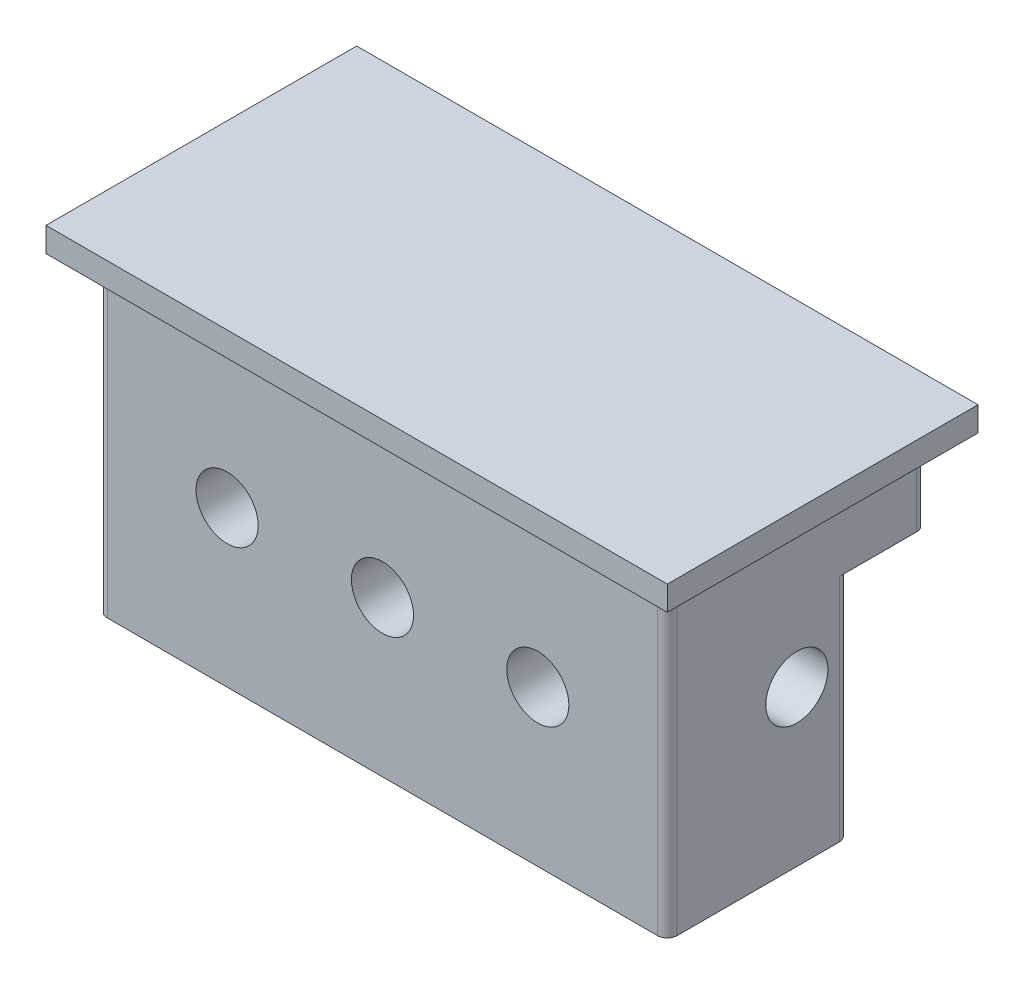
ISO-10303-21;
HEADER;
FILE_DESCRIPTION(('STEP AP214'),'2;1');
FILE_NAME('part.step','',(''),(''),'','','');
FILE_SCHEMA(('AUTOMOTIVE_DESIGN { 1 0 10303 214 1 1 1 1 }'));
ENDSEC;
DATA;
#1=APPLICATION_CONTEXT('core data for automotive mechanical design processes');
#2=APPLICATION_PROTOCOL_DEFINITION('international standard','automotive_design',2000,#1);
#3=PRODUCT_CONTEXT('',#1,'mechanical');
#4=PRODUCT('Part','Part','',(#3));
#5=PRODUCT_RELATED_PRODUCT_CATEGORY('part','',(#4));
#6=PRODUCT_DEFINITION_FORMATION('','',#4);
#7=PRODUCT_DEFINITION_CONTEXT('part definition',#1,'design');
#8=PRODUCT_DEFINITION('design','',#6,#7);
#9=PRODUCT_DEFINITION_SHAPE('','',#8);
#10=(LENGTH_UNIT() NAMED_UNIT(*) SI_UNIT(.MILLI.,.METRE.));
#11=(NAMED_UNIT(*) PLANE_ANGLE_UNIT() SI_UNIT($,.RADIAN.));
#12=(NAMED_UNIT(*) SI_UNIT($,.STERADIAN.) SOLID_ANGLE_UNIT());
#13=UNCERTAINTY_MEASURE_WITH_UNIT(LENGTH_MEASURE(1.E-05),#10,'distance_accuracy_value','');
#14=(GEOMETRIC_REPRESENTATION_CONTEXT(3) GLOBAL_UNCERTAINTY_ASSIGNED_CONTEXT((#13)) GLOBAL_UNIT_ASSIGNED_CONTEXT((#10,
#11,#12)) REPRESENTATION_CONTEXT('',''));
#15=CARTESIAN_POINT('',(0.,0.,0.));
#16=DIRECTION('',(0.,0.,1.));
#17=DIRECTION('',(1.,0.,0.));
#18=AXIS2_PLACEMENT_3D('',#15,#16,#17);
#19=CARTESIAN_POINT('',(0.,-12.7,-12.7));
#20=DIRECTION('',(1.,0.,0.));
#21=DIRECTION('',(0.,0.,-1.));
#22=AXIS2_PLACEMENT_3D('',#19,#20,#21);
#23=CYLINDRICAL_SURFACE('',#22,2.54000000000001);
#24=CARTESIAN_POINT('',(48.6918,-12.7,-12.7));
#25=DIRECTION('',(1.,0.,0.));
#26=DIRECTION('',(0.,0.,-1.));
#27=AXIS2_PLACEMENT_3D('',#24,#25,#26);
#28=CIRCLE('',#27,2.54000000000001);
#29=CARTESIAN_POINT('',(48.6918,-12.7,-15.24));
#30=VERTEX_POINT('',#29);
#31=EDGE_CURVE('E417',#30,#30,#28,.T.);
#32=ORIENTED_EDGE('',*,*,#31,.T.);
#33=EDGE_LOOP('',(#32));
#34=FACE_BOUND('',#33,.T.);
#35=CARTESIAN_POINT('',(38.1,-12.7,-12.7));
#36=DIRECTION('',(0.707106781186547,0.,0.707106781186548));
#37=DIRECTION('',(0.707106781186547,0.,-0.707106781186548));
#38=AXIS2_PLACEMENT_3D('',#35,#36,#37);
#39=ELLIPSE('',#38,3.59210244842768,2.54000000000001);
#40=CARTESIAN_POINT('',(38.1,-10.16,-12.7));
#41=VERTEX_POINT('',#40);
#42=CARTESIAN_POINT('',(38.1,-15.24,-12.7));
#43=VERTEX_POINT('',#42);
#44=EDGE_CURVE('E230',#41,#43,#39,.F.);
#45=ORIENTED_EDGE('',*,*,#44,.T.);
#46=CARTESIAN_POINT('',(38.1,-12.7,-12.7));
#47=DIRECTION('',(0.707106781186547,0.,-0.707106781186548));
#48=DIRECTION('',(0.707106781186547,0.,0.707106781186548));
#49=AXIS2_PLACEMENT_3D('',#46,#47,#48);
#50=ELLIPSE('',#49,3.59210244842768,2.54000000000001);
#51=EDGE_CURVE('E238',#43,#41,#50,.F.);
#52=ORIENTED_EDGE('',*,*,#51,.T.);
#53=EDGE_LOOP('',(#45,#52));
#54=FACE_BOUND('',#53,.T.);
#55=ADVANCED_FACE('F37',(#34,#54),#23,.F.);
#56=CARTESIAN_POINT('',(0.,0.,0.));
#57=DIRECTION('',(0.,1.,0.));
#58=DIRECTION('',(0.,0.,1.));
#59=AXIS2_PLACEMENT_3D('',#56,#57,#58);
#60=PLANE('',#59);
#61=DIRECTION('',(1.,0.,0.));
#62=VECTOR('',#61,1.);
#63=CARTESIAN_POINT('',(0.,0.,0.));
#64=LINE('',#63,#62);
#65=CARTESIAN_POINT('',(0.,0.,0.));
#66=VERTEX_POINT('',#65);
#67=CARTESIAN_POINT('',(50.8,0.,0.));
#68=VERTEX_POINT('',#67);
#69=EDGE_CURVE('E297',#66,#68,#64,.T.);
#70=ORIENTED_EDGE('',*,*,#69,.F.);
#71=DIRECTION('',(0.,0.,-1.));
#72=VECTOR('',#71,1.);
#73=CARTESIAN_POINT('',(0.,0.,0.));
#74=LINE('',#73,#72);
#75=CARTESIAN_POINT('',(0.,0.,-25.4));
#76=VERTEX_POINT('',#75);
#77=EDGE_CURVE('E324',#66,#76,#74,.T.);
#78=ORIENTED_EDGE('',*,*,#77,.T.);
#79=DIRECTION('',(1.,0.,0.));
#80=VECTOR('',#79,1.);
#81=CARTESIAN_POINT('',(0.,0.,-25.4));
#82=LINE('',#81,#80);
#83=CARTESIAN_POINT('',(50.8,0.,-25.4));
#84=VERTEX_POINT('',#83);
#85=EDGE_CURVE('E335',#76,#84,#82,.T.);
#86=ORIENTED_EDGE('',*,*,#85,.T.);
#87=DIRECTION('',(0.,0.,-1.));
#88=VECTOR('',#87,1.);
#89=CARTESIAN_POINT('',(50.8,0.,0.));
#90=LINE('',#89,#88);
#91=EDGE_CURVE('E301',#68,#84,#90,.T.);
#92=ORIENTED_EDGE('',*,*,#91,.F.);
#93=EDGE_LOOP('',(#70,#78,#86,#92));
#94=FACE_BOUND('',#93,.T.);
#95=DIRECTION('',(0.,0.,-1.));
#96=VECTOR('',#95,1.);
#97=CARTESIAN_POINT('',(2.1082,0.,0.));
#98=LINE('',#97,#96);
#99=CARTESIAN_POINT('',(2.1082,0.,-2.90195));
#100=VERTEX_POINT('',#99);
#101=CARTESIAN_POINT('',(2.1082,0.,-22.49805));
#102=VERTEX_POINT('',#101);
#103=EDGE_CURVE('E308',#100,#102,#98,.T.);
#104=ORIENTED_EDGE('',*,*,#103,.F.);
#105=CARTESIAN_POINT('',(2.90195,0.,-2.90195));
#106=DIRECTION('',(0.,1.,0.));
#107=DIRECTION('',(0.,0.,1.));
#108=AXIS2_PLACEMENT_3D('',#105,#106,#107);
#109=CIRCLE('',#108,0.79375);
#110=CARTESIAN_POINT('',(2.90195,0.,-2.1082));
#111=VERTEX_POINT('',#110);
#112=EDGE_CURVE('E215',#100,#111,#109,.T.);
#113=ORIENTED_EDGE('',*,*,#112,.T.);
#114=DIRECTION('',(1.,0.,0.));
#115=VECTOR('',#114,1.);
#116=CARTESIAN_POINT('',(0.,0.,-2.1082));
#117=LINE('',#116,#115);
#118=CARTESIAN_POINT('',(47.89805,0.,-2.1082));
#119=VERTEX_POINT('',#118);
#120=EDGE_CURVE('E311',#111,#119,#117,.T.);
#121=ORIENTED_EDGE('',*,*,#120,.T.);
#122=CARTESIAN_POINT('',(47.89805,0.,-2.90195));
#123=DIRECTION('',(0.,1.,0.));
#124=DIRECTION('',(0.,0.,1.));
#125=AXIS2_PLACEMENT_3D('',#122,#123,#124);
#126=CIRCLE('',#125,0.79375);
#127=CARTESIAN_POINT('',(48.6918,0.,-2.90195));
#128=VERTEX_POINT('',#127);
#129=EDGE_CURVE('E213',#119,#128,#126,.T.);
#130=ORIENTED_EDGE('',*,*,#129,.T.);
#131=DIRECTION('',(0.,0.,-1.));
#132=VECTOR('',#131,1.);
#133=CARTESIAN_POINT('',(48.6918,0.,0.));
#134=LINE('',#133,#132);
#135=CARTESIAN_POINT('',(48.6918,0.,-22.49805));
#136=VERTEX_POINT('',#135);
#137=EDGE_CURVE('E315',#128,#136,#134,.T.);
#138=ORIENTED_EDGE('',*,*,#137,.T.);
#139=CARTESIAN_POINT('',(47.89805,0.,-22.49805));
#140=DIRECTION('',(0.,1.,0.));
#141=DIRECTION('',(0.,0.,1.));
#142=AXIS2_PLACEMENT_3D('',#139,#140,#141);
#143=CIRCLE('',#142,0.79375);
#144=CARTESIAN_POINT('',(47.89805,0.,-23.2918));
#145=VERTEX_POINT('',#144);
#146=EDGE_CURVE('E217',#136,#145,#143,.T.);
#147=ORIENTED_EDGE('',*,*,#146,.T.);
#148=DIRECTION('',(1.,0.,0.));
#149=VECTOR('',#148,1.);
#150=CARTESIAN_POINT('',(0.,0.,-23.2918));
#151=LINE('',#150,#149);
#152=CARTESIAN_POINT('',(2.90195,0.,-23.2918));
#153=VERTEX_POINT('',#152);
#154=EDGE_CURVE('E318',#153,#145,#151,.T.);
#155=ORIENTED_EDGE('',*,*,#154,.F.);
#156=CARTESIAN_POINT('',(2.90195,0.,-22.49805));
#157=DIRECTION('',(0.,1.,0.));
#158=DIRECTION('',(0.,0.,1.));
#159=AXIS2_PLACEMENT_3D('',#156,#157,#158);
#160=CIRCLE('',#159,0.79375);
#161=EDGE_CURVE('E187',#153,#102,#160,.T.);
#162=ORIENTED_EDGE('',*,*,#161,.T.);
#163=EDGE_LOOP('',(#104,#113,#121,#130,#138,#147,#155,#162));
#164=FACE_BOUND('',#163,.T.);
#165=ADVANCED_FACE('F355',(#94,#164),#60,.F.);
#166=CARTESIAN_POINT('',(0.,1.999996,0.));
#167=DIRECTION('',(0.,0.,-1.));
#168=DIRECTION('',(-1.,0.,0.));
#169=AXIS2_PLACEMENT_3D('',#166,#167,#168);
#170=PLANE('',#169);
#171=ORIENTED_EDGE('',*,*,#69,.T.);
#172=DIRECTION('',(0.,-1.,0.));
#173=VECTOR('',#172,1.);
#174=CARTESIAN_POINT('',(50.8,1.999996,0.));
#175=LINE('',#174,#173);
#176=CARTESIAN_POINT('',(50.8,1.999996,0.));
#177=VERTEX_POINT('',#176);
#178=EDGE_CURVE('E194',#177,#68,#175,.T.);
#179=ORIENTED_EDGE('',*,*,#178,.F.);
#180=DIRECTION('',(1.,0.,0.));
#181=VECTOR('',#180,1.);
#182=CARTESIAN_POINT('',(0.,1.999996,0.));
#183=LINE('',#182,#181);
#184=CARTESIAN_POINT('',(0.,1.999996,0.));
#185=VERTEX_POINT('',#184);
#186=EDGE_CURVE('E320',#185,#177,#183,.T.);
#187=ORIENTED_EDGE('',*,*,#186,.F.);
#188=DIRECTION('',(0.,-1.,0.));
#189=VECTOR('',#188,1.);
#190=CARTESIAN_POINT('',(0.,1.999996,0.));
#191=LINE('',#190,#189);
#192=EDGE_CURVE('E331',#185,#66,#191,.T.);
#193=ORIENTED_EDGE('',*,*,#192,.T.);
#194=EDGE_LOOP('',(#171,#179,#187,#193));
#195=FACE_BOUND('',#194,.T.);
#196=ADVANCED_FACE('F352',(#195),#170,.F.);
#197=CARTESIAN_POINT('',(50.8,1.999996,0.));
#198=DIRECTION('',(-1.,0.,0.));
#199=DIRECTION('',(0.,0.,1.));
#200=AXIS2_PLACEMENT_3D('',#197,#198,#199);
#201=PLANE('',#200);
#202=ORIENTED_EDGE('',*,*,#91,.T.);
#203=DIRECTION('',(0.,-1.,0.));
#204=VECTOR('',#203,1.);
#205=CARTESIAN_POINT('',(50.8,1.999996,-25.4));
#206=LINE('',#205,#204);
#207=CARTESIAN_POINT('',(50.8,1.999996,-25.4));
#208=VERTEX_POINT('',#207);
#209=EDGE_CURVE('E343',#208,#84,#206,.T.);
#210=ORIENTED_EDGE('',*,*,#209,.F.);
#211=DIRECTION('',(0.,0.,-1.));
#212=VECTOR('',#211,1.);
#213=CARTESIAN_POINT('',(50.8,1.999996,0.));
#214=LINE('',#213,#212);
#215=EDGE_CURVE('E323',#177,#208,#214,.T.);
#216=ORIENTED_EDGE('',*,*,#215,.F.);
#217=ORIENTED_EDGE('',*,*,#178,.T.);
#218=EDGE_LOOP('',(#202,#210,#216,#217));
#219=FACE_BOUND('',#218,.T.);
#220=ADVANCED_FACE('F347',(#219),#201,.F.);
#221=CARTESIAN_POINT('',(0.,1.999996,-25.4));
#222=DIRECTION('',(0.,0.,-1.));
#223=DIRECTION('',(-1.,0.,0.));
#224=AXIS2_PLACEMENT_3D('',#221,#222,#223);
#225=PLANE('',#224);
#226=ORIENTED_EDGE('',*,*,#85,.F.);
#227=DIRECTION('',(0.,-1.,0.));
#228=VECTOR('',#227,1.);
#229=CARTESIAN_POINT('',(0.,1.999996,-25.4));
#230=LINE('',#229,#228);
#231=CARTESIAN_POINT('',(0.,1.999996,-25.4));
#232=VERTEX_POINT('',#231);
#233=EDGE_CURVE('E341',#232,#76,#230,.T.);
#234=ORIENTED_EDGE('',*,*,#233,.F.);
#235=DIRECTION('',(1.,0.,0.));
#236=VECTOR('',#235,1.);
#237=CARTESIAN_POINT('',(0.,1.999996,-25.4));
#238=LINE('',#237,#236);
#239=EDGE_CURVE('E326',#232,#208,#238,.T.);
#240=ORIENTED_EDGE('',*,*,#239,.T.);
#241=ORIENTED_EDGE('',*,*,#209,.T.);
#242=EDGE_LOOP('',(#226,#234,#240,#241));
#243=FACE_BOUND('',#242,.T.);
#244=ADVANCED_FACE('F363',(#243),#225,.T.);
#245=CARTESIAN_POINT('',(0.,1.999996,0.));
#246=DIRECTION('',(-1.,0.,0.));
#247=DIRECTION('',(0.,0.,1.));
#248=AXIS2_PLACEMENT_3D('',#245,#246,#247);
#249=PLANE('',#248);
#250=ORIENTED_EDGE('',*,*,#77,.F.);
#251=ORIENTED_EDGE('',*,*,#192,.F.);
#252=DIRECTION('',(0.,0.,-1.));
#253=VECTOR('',#252,1.);
#254=CARTESIAN_POINT('',(0.,1.999996,0.));
#255=LINE('',#254,#253);
#256=EDGE_CURVE('E329',#185,#232,#255,.T.);
#257=ORIENTED_EDGE('',*,*,#256,.T.);
#258=ORIENTED_EDGE('',*,*,#233,.T.);
#259=EDGE_LOOP('',(#250,#251,#257,#258));
#260=FACE_BOUND('',#259,.T.);
#261=ADVANCED_FACE('F358',(#260),#249,.T.);
#262=CARTESIAN_POINT('',(0.,1.999996,0.));
#263=DIRECTION('',(0.,1.,0.));
#264=DIRECTION('',(0.,0.,1.));
#265=AXIS2_PLACEMENT_3D('',#262,#263,#264);
#266=PLANE('',#265);
#267=ORIENTED_EDGE('',*,*,#186,.T.);
#268=ORIENTED_EDGE('',*,*,#215,.T.);
#269=ORIENTED_EDGE('',*,*,#239,.F.);
#270=ORIENTED_EDGE('',*,*,#256,.F.);
#271=EDGE_LOOP('',(#267,#268,#269,#270));
#272=FACE_BOUND('',#271,.T.);
#273=ADVANCED_FACE('F365',(#272),#266,.T.);
#274=CARTESIAN_POINT('',(2.1082,-25.4,0.));
#275=DIRECTION('',(1.,0.,0.));
#276=DIRECTION('',(0.,0.,-1.));
#277=AXIS2_PLACEMENT_3D('',#274,#275,#276);
#278=PLANE('',#277);
#279=CARTESIAN_POINT('',(2.1082,-12.7,-12.7));
#280=DIRECTION('',(1.,0.,0.));
#281=DIRECTION('',(0.,0.,-1.));
#282=AXIS2_PLACEMENT_3D('',#279,#280,#281);
#283=CIRCLE('',#282,2.54000000000001);
#284=CARTESIAN_POINT('',(2.1082,-12.7,-15.24));
#285=VERTEX_POINT('',#284);
#286=EDGE_CURVE('E312',#285,#285,#283,.T.);
#287=ORIENTED_EDGE('',*,*,#286,.T.);
#288=EDGE_LOOP('',(#287));
#289=FACE_BOUND('',#288,.T.);
#290=DIRECTION('',(0.,0.,-1.));
#291=VECTOR('',#290,1.);
#292=CARTESIAN_POINT('',(2.1082,-6.604,-16.9418));
#293=LINE('',#292,#291);
#294=CARTESIAN_POINT('',(2.1082,-6.604,-16.1798));
#295=VERTEX_POINT('',#294);
#296=CARTESIAN_POINT('',(2.1082,-6.604,-22.49805));
#297=VERTEX_POINT('',#296);
#298=EDGE_CURVE('E52',#295,#297,#293,.T.);
#299=ORIENTED_EDGE('',*,*,#298,.F.);
#300=DIRECTION('',(0.,1.,0.));
#301=VECTOR('',#300,1.);
#302=CARTESIAN_POINT('',(2.1082,-25.4,-16.1798));
#303=LINE('',#302,#301);
#304=CARTESIAN_POINT('',(2.1082,-25.4,-16.1798));
#305=VERTEX_POINT('',#304);
#306=EDGE_CURVE('E270',#295,#305,#303,.F.);
#307=ORIENTED_EDGE('',*,*,#306,.T.);
#308=DIRECTION('',(0.,0.,-1.));
#309=VECTOR('',#308,1.);
#310=CARTESIAN_POINT('',(2.1082,-25.4,0.));
#311=LINE('',#310,#309);
#312=CARTESIAN_POINT('',(2.1082,-25.4,-2.90195));
#313=VERTEX_POINT('',#312);
#314=EDGE_CURVE('E304',#313,#305,#311,.T.);
#315=ORIENTED_EDGE('',*,*,#314,.F.);
#316=DIRECTION('',(0.,1.,0.));
#317=VECTOR('',#316,1.);
#318=CARTESIAN_POINT('',(2.1082,0.,-2.90195));
#319=LINE('',#318,#317);
#320=EDGE_CURVE('E189',#313,#100,#319,.T.);
#321=ORIENTED_EDGE('',*,*,#320,.T.);
#322=ORIENTED_EDGE('',*,*,#103,.T.);
#323=DIRECTION('',(0.,1.,0.));
#324=VECTOR('',#323,1.);
#325=CARTESIAN_POINT('',(2.1082,-25.4,-22.49805));
#326=LINE('',#325,#324);
#327=EDGE_CURVE('E192',#102,#297,#326,.F.);
#328=ORIENTED_EDGE('',*,*,#327,.T.);
#329=EDGE_LOOP('',(#299,#307,#315,#321,#322,#328));
#330=FACE_BOUND('',#329,.T.);
#331=ADVANCED_FACE('F367',(#289,#330),#278,.F.);
#332=CARTESIAN_POINT('',(0.,-25.4,-23.2918));
#333=DIRECTION('',(0.,0.,1.));
#334=DIRECTION('',(1.,0.,0.));
#335=AXIS2_PLACEMENT_3D('',#332,#333,#334);
#336=PLANE('',#335);
#337=DIRECTION('',(0.,1.,0.));
#338=VECTOR('',#337,1.);
#339=CARTESIAN_POINT('',(47.89805,-25.4,-23.2918));
#340=LINE('',#339,#338);
#341=CARTESIAN_POINT('',(47.89805,-6.604,-23.2918));
#342=VERTEX_POINT('',#341);
#343=EDGE_CURVE('E183',#145,#342,#340,.F.);
#344=ORIENTED_EDGE('',*,*,#343,.T.);
#345=DIRECTION('',(1.,0.,0.));
#346=VECTOR('',#345,1.);
#347=CARTESIAN_POINT('',(48.6918,-6.604,-23.2918));
#348=LINE('',#347,#346);
#349=CARTESIAN_POINT('',(2.90195,-6.604,-23.2918));
#350=VERTEX_POINT('',#349);
#351=EDGE_CURVE('E168',#350,#342,#348,.T.);
#352=ORIENTED_EDGE('',*,*,#351,.F.);
#353=DIRECTION('',(0.,1.,0.));
#354=VECTOR('',#353,1.);
#355=CARTESIAN_POINT('',(2.90195,-25.4,-23.2918));
#356=LINE('',#355,#354);
#357=EDGE_CURVE('E180',#350,#153,#356,.T.);
#358=ORIENTED_EDGE('',*,*,#357,.T.);
#359=ORIENTED_EDGE('',*,*,#154,.T.);
#360=EDGE_LOOP('',(#344,#352,#358,#359));
#361=FACE_BOUND('',#360,.T.);
#362=ADVANCED_FACE('F178',(#361),#336,.F.);
#363=CARTESIAN_POINT('',(48.6918,-25.4,0.));
#364=DIRECTION('',(1.,0.,0.));
#365=DIRECTION('',(0.,0.,-1.));
#366=AXIS2_PLACEMENT_3D('',#363,#364,#365);
#367=PLANE('',#366);
#368=DIRECTION('',(0.,0.,-1.));
#369=VECTOR('',#368,1.);
#370=CARTESIAN_POINT('',(48.6918,-25.4,0.));
#371=LINE('',#370,#369);
#372=CARTESIAN_POINT('',(48.6918,-25.4,-2.90195));
#373=VERTEX_POINT('',#372);
#374=CARTESIAN_POINT('',(48.6918,-25.4,-16.1798));
#375=VERTEX_POINT('',#374);
#376=EDGE_CURVE('E290',#373,#375,#371,.T.);
#377=ORIENTED_EDGE('',*,*,#376,.T.);
#378=DIRECTION('',(0.,-1.,0.));
#379=VECTOR('',#378,1.);
#380=CARTESIAN_POINT('',(48.6918,-6.604,-16.1798));
#381=LINE('',#380,#379);
#382=CARTESIAN_POINT('',(48.6918,-6.604,-16.1798));
#383=VERTEX_POINT('',#382);
#384=EDGE_CURVE('E268',#375,#383,#381,.F.);
#385=ORIENTED_EDGE('',*,*,#384,.T.);
#386=DIRECTION('',(0.,0.,-1.));
#387=VECTOR('',#386,1.);
#388=CARTESIAN_POINT('',(48.6918,-6.604,-16.9418));
#389=LINE('',#388,#387);
#390=CARTESIAN_POINT('',(48.6918,-6.604,-22.49805));
#391=VERTEX_POINT('',#390);
#392=EDGE_CURVE('E59',#383,#391,#389,.T.);
#393=ORIENTED_EDGE('',*,*,#392,.T.);
#394=DIRECTION('',(0.,1.,0.));
#395=VECTOR('',#394,1.);
#396=CARTESIAN_POINT('',(48.6918,0.,-22.49805));
#397=LINE('',#396,#395);
#398=EDGE_CURVE('E208',#391,#136,#397,.T.);
#399=ORIENTED_EDGE('',*,*,#398,.T.);
#400=ORIENTED_EDGE('',*,*,#137,.F.);
#401=DIRECTION('',(0.,1.,0.));
#402=VECTOR('',#401,1.);
#403=CARTESIAN_POINT('',(48.6918,-25.4,-2.90195));
#404=LINE('',#403,#402);
#405=EDGE_CURVE('E210',#128,#373,#404,.F.);
#406=ORIENTED_EDGE('',*,*,#405,.T.);
#407=EDGE_LOOP('',(#377,#385,#393,#399,#400,#406));
#408=FACE_BOUND('',#407,.T.);
#409=ORIENTED_EDGE('',*,*,#31,.F.);
#410=EDGE_LOOP('',(#409));
#411=FACE_BOUND('',#410,.T.);
#412=ADVANCED_FACE('F293',(#408,#411),#367,.T.);
#413=CARTESIAN_POINT('',(0.,-25.4,-2.1082));
#414=DIRECTION('',(0.,0.,1.));
#415=DIRECTION('',(1.,0.,0.));
#416=AXIS2_PLACEMENT_3D('',#413,#414,#415);
#417=PLANE('',#416);
#418=CARTESIAN_POINT('',(12.7,-12.7,-2.1082));
#419=DIRECTION('',(0.,0.,1.));
#420=DIRECTION('',(1.,0.,0.));
#421=AXIS2_PLACEMENT_3D('',#418,#419,#420);
#422=CIRCLE('',#421,2.54000000000001);
#423=CARTESIAN_POINT('',(15.24,-12.7,-2.1082));
#424=VERTEX_POINT('',#423);
#425=EDGE_CURVE('E419',#424,#424,#422,.T.);
#426=ORIENTED_EDGE('',*,*,#425,.F.);
#427=EDGE_LOOP('',(#426));
#428=FACE_BOUND('',#427,.T.);
#429=CARTESIAN_POINT('',(38.1,-12.7,-2.1082));
#430=DIRECTION('',(0.,0.,1.));
#431=DIRECTION('',(1.,0.,0.));
#432=AXIS2_PLACEMENT_3D('',#429,#430,#431);
#433=CIRCLE('',#432,2.54000000000002);
#434=CARTESIAN_POINT('',(40.64,-12.7,-2.1082));
#435=VERTEX_POINT('',#434);
#436=EDGE_CURVE('E637',#435,#435,#433,.T.);
#437=ORIENTED_EDGE('',*,*,#436,.F.);
#438=EDGE_LOOP('',(#437));
#439=FACE_BOUND('',#438,.T.);
#440=CARTESIAN_POINT('',(25.4,-12.7,-2.1082));
#441=DIRECTION('',(0.,0.,1.));
#442=DIRECTION('',(1.,0.,0.));
#443=AXIS2_PLACEMENT_3D('',#440,#441,#442);
#444=CIRCLE('',#443,2.54);
#445=CARTESIAN_POINT('',(27.94,-12.7,-2.1082));
#446=VERTEX_POINT('',#445);
#447=EDGE_CURVE('E173',#446,#446,#444,.T.);
#448=ORIENTED_EDGE('',*,*,#447,.F.);
#449=EDGE_LOOP('',(#448));
#450=FACE_BOUND('',#449,.T.);
#451=DIRECTION('',(1.,0.,0.));
#452=VECTOR('',#451,1.);
#453=CARTESIAN_POINT('',(0.,-25.4,-2.1082));
#454=LINE('',#453,#452);
#455=CARTESIAN_POINT('',(2.90195,-25.4,-2.1082));
#456=VERTEX_POINT('',#455);
#457=CARTESIAN_POINT('',(47.89805,-25.4,-2.1082));
#458=VERTEX_POINT('',#457);
#459=EDGE_CURVE('E298',#456,#458,#454,.T.);
#460=ORIENTED_EDGE('',*,*,#459,.T.);
#461=DIRECTION('',(0.,1.,0.));
#462=VECTOR('',#461,1.);
#463=CARTESIAN_POINT('',(47.89805,-25.4,-2.1082));
#464=LINE('',#463,#462);
#465=EDGE_CURVE('E205',#458,#119,#464,.T.);
#466=ORIENTED_EDGE('',*,*,#465,.T.);
#467=ORIENTED_EDGE('',*,*,#120,.F.);
#468=DIRECTION('',(0.,1.,0.));
#469=VECTOR('',#468,1.);
#470=CARTESIAN_POINT('',(2.90195,-25.4,-2.1082));
#471=LINE('',#470,#469);
#472=EDGE_CURVE('E203',#111,#456,#471,.F.);
#473=ORIENTED_EDGE('',*,*,#472,.T.);
#474=EDGE_LOOP('',(#460,#466,#467,#473));
#475=FACE_BOUND('',#474,.T.);
#476=ADVANCED_FACE('F497',(#428,#439,#450,#475),#417,.T.);
#477=CARTESIAN_POINT('',(0.,-25.4,0.));
#478=DIRECTION('',(0.,1.,0.));
#479=DIRECTION('',(0.,0.,1.));
#480=AXIS2_PLACEMENT_3D('',#477,#478,#479);
#481=PLANE('',#480);
#482=DIRECTION('',(-1.,0.,0.));
#483=VECTOR('',#482,1.);
#484=CARTESIAN_POINT('',(48.6918,-25.4,-16.9418));
#485=LINE('',#484,#483);
#486=CARTESIAN_POINT('',(47.9298,-25.4,-16.9418));
#487=VERTEX_POINT('',#486);
#488=CARTESIAN_POINT('',(2.8702,-25.4,-16.9418));
#489=VERTEX_POINT('',#488);
#490=EDGE_CURVE('E184',#487,#489,#485,.T.);
#491=ORIENTED_EDGE('',*,*,#490,.F.);
#492=CARTESIAN_POINT('',(47.9298,-25.4,-16.1798));
#493=DIRECTION('',(0.,1.,0.));
#494=DIRECTION('',(0.,0.,1.));
#495=AXIS2_PLACEMENT_3D('',#492,#493,#494);
#496=CIRCLE('',#495,0.762);
#497=EDGE_CURVE('E266',#487,#375,#496,.F.);
#498=ORIENTED_EDGE('',*,*,#497,.T.);
#499=ORIENTED_EDGE('',*,*,#376,.F.);
#500=CARTESIAN_POINT('',(47.89805,-25.4,-2.90195));
#501=DIRECTION('',(0.,1.,0.));
#502=DIRECTION('',(0.,0.,1.));
#503=AXIS2_PLACEMENT_3D('',#500,#501,#502);
#504=CIRCLE('',#503,0.79375);
#505=EDGE_CURVE('E201',#373,#458,#504,.F.);
#506=ORIENTED_EDGE('',*,*,#505,.T.);
#507=ORIENTED_EDGE('',*,*,#459,.F.);
#508=CARTESIAN_POINT('',(2.90195,-25.4,-2.90195));
#509=DIRECTION('',(0.,1.,0.));
#510=DIRECTION('',(0.,0.,1.));
#511=AXIS2_PLACEMENT_3D('',#508,#509,#510);
#512=CIRCLE('',#511,0.79375);
#513=EDGE_CURVE('E199',#456,#313,#512,.F.);
#514=ORIENTED_EDGE('',*,*,#513,.T.);
#515=ORIENTED_EDGE('',*,*,#314,.T.);
#516=CARTESIAN_POINT('',(2.8702,-25.4,-16.1798));
#517=DIRECTION('',(0.,1.,0.));
#518=DIRECTION('',(0.,0.,1.));
#519=AXIS2_PLACEMENT_3D('',#516,#517,#518);
#520=CIRCLE('',#519,0.762);
#521=EDGE_CURVE('E264',#305,#489,#520,.F.);
#522=ORIENTED_EDGE('',*,*,#521,.T.);
#523=EDGE_LOOP('',(#491,#498,#499,#506,#507,#514,#515,#522));
#524=FACE_BOUND('',#523,.T.);
#525=ADVANCED_FACE('F289',(#524),#481,.F.);
#526=CARTESIAN_POINT('',(2.90195,-25.4,-22.49805));
#527=DIRECTION('',(0.,1.,0.));
#528=DIRECTION('',(0.,0.,1.));
#529=AXIS2_PLACEMENT_3D('',#526,#527,#528);
#530=CYLINDRICAL_SURFACE('',#529,0.79375);
#531=CARTESIAN_POINT('',(2.90195,-6.604,-22.49805));
#532=DIRECTION('',(0.,1.,0.));
#533=DIRECTION('',(0.,0.,1.));
#534=AXIS2_PLACEMENT_3D('',#531,#532,#533);
#535=CIRCLE('',#534,0.79375);
#536=EDGE_CURVE('E165',#297,#350,#535,.F.);
#537=ORIENTED_EDGE('',*,*,#536,.F.);
#538=ORIENTED_EDGE('',*,*,#327,.F.);
#539=ORIENTED_EDGE('',*,*,#161,.F.);
#540=ORIENTED_EDGE('',*,*,#357,.F.);
#541=EDGE_LOOP('',(#537,#538,#539,#540));
#542=FACE_BOUND('',#541,.T.);
#543=ADVANCED_FACE('F186',(#542),#530,.T.);
#544=CARTESIAN_POINT('',(47.89805,-25.4,-2.90195));
#545=DIRECTION('',(0.,1.,0.));
#546=DIRECTION('',(0.,0.,1.));
#547=AXIS2_PLACEMENT_3D('',#544,#545,#546);
#548=CYLINDRICAL_SURFACE('',#547,0.79375);
#549=ORIENTED_EDGE('',*,*,#505,.F.);
#550=ORIENTED_EDGE('',*,*,#405,.F.);
#551=ORIENTED_EDGE('',*,*,#129,.F.);
#552=ORIENTED_EDGE('',*,*,#465,.F.);
#553=EDGE_LOOP('',(#549,#550,#551,#552));
#554=FACE_BOUND('',#553,.T.);
#555=ADVANCED_FACE('F441',(#554),#548,.T.);
#556=CARTESIAN_POINT('',(2.90195,-25.4,-2.90195));
#557=DIRECTION('',(0.,-1.,0.));
#558=DIRECTION('',(0.,0.,-1.));
#559=AXIS2_PLACEMENT_3D('',#556,#557,#558);
#560=CYLINDRICAL_SURFACE('',#559,0.79375);
#561=ORIENTED_EDGE('',*,*,#513,.F.);
#562=ORIENTED_EDGE('',*,*,#472,.F.);
#563=ORIENTED_EDGE('',*,*,#112,.F.);
#564=ORIENTED_EDGE('',*,*,#320,.F.);
#565=EDGE_LOOP('',(#561,#562,#563,#564));
#566=FACE_BOUND('',#565,.T.);
#567=ADVANCED_FACE('F411',(#566),#560,.T.);
#568=CARTESIAN_POINT('',(47.89805,-25.4,-22.49805));
#569=DIRECTION('',(0.,-1.,0.));
#570=DIRECTION('',(0.,0.,-1.));
#571=AXIS2_PLACEMENT_3D('',#568,#569,#570);
#572=CYLINDRICAL_SURFACE('',#571,0.79375);
#573=CARTESIAN_POINT('',(47.89805,-6.604,-22.49805));
#574=DIRECTION('',(0.,1.,0.));
#575=DIRECTION('',(0.,0.,1.));
#576=AXIS2_PLACEMENT_3D('',#573,#574,#575);
#577=CIRCLE('',#576,0.79375);
#578=EDGE_CURVE('E252',#342,#391,#577,.F.);
#579=ORIENTED_EDGE('',*,*,#578,.F.);
#580=ORIENTED_EDGE('',*,*,#343,.F.);
#581=ORIENTED_EDGE('',*,*,#146,.F.);
#582=ORIENTED_EDGE('',*,*,#398,.F.);
#583=EDGE_LOOP('',(#579,#580,#581,#582));
#584=FACE_BOUND('',#583,.T.);
#585=ADVANCED_FACE('F406',(#584),#572,.T.);
#586=CARTESIAN_POINT('',(12.7,-12.7,-12.7));
#587=DIRECTION('',(0.707106781186547,0.,0.707106781186548));
#588=DIRECTION('',(0.707106781186547,0.,-0.707106781186548));
#589=AXIS2_PLACEMENT_3D('',#586,#587,#588);
#590=ELLIPSE('',#589,3.59210244842767,2.54000000000001);
#591=CARTESIAN_POINT('',(12.7,-10.16,-12.7));
#592=VERTEX_POINT('',#591);
#593=CARTESIAN_POINT('',(12.7,-15.24,-12.7));
#594=VERTEX_POINT('',#593);
#595=EDGE_CURVE('E243',#592,#594,#590,.T.);
#596=ORIENTED_EDGE('',*,*,#595,.T.);
#597=CARTESIAN_POINT('',(12.7,-12.7,-12.7));
#598=DIRECTION('',(0.707106781186547,0.,-0.707106781186548));
#599=DIRECTION('',(0.707106781186547,0.,0.707106781186548));
#600=AXIS2_PLACEMENT_3D('',#597,#598,#599);
#601=ELLIPSE('',#600,3.59210244842767,2.54000000000001);
#602=EDGE_CURVE('E246',#594,#592,#601,.T.);
#603=ORIENTED_EDGE('',*,*,#602,.T.);
#604=EDGE_LOOP('',(#596,#603));
#605=FACE_BOUND('',#604,.T.);
#606=ORIENTED_EDGE('',*,*,#286,.F.);
#607=EDGE_LOOP('',(#606));
#608=FACE_BOUND('',#607,.T.);
#609=ADVANCED_FACE('F387',(#605,#608),#23,.F.);
#610=CARTESIAN_POINT('',(25.4,-12.7,0.));
#611=DIRECTION('',(0.,0.,-1.));
#612=DIRECTION('',(-1.,0.,0.));
#613=AXIS2_PLACEMENT_3D('',#610,#611,#612);
#614=CYLINDRICAL_SURFACE('',#613,2.54);
#615=CARTESIAN_POINT('',(25.4,-12.7,-16.9418));
#616=DIRECTION('',(0.,0.,1.));
#617=DIRECTION('',(1.,0.,0.));
#618=AXIS2_PLACEMENT_3D('',#615,#616,#617);
#619=CIRCLE('',#618,2.54);
#620=CARTESIAN_POINT('',(27.94,-12.7,-16.9418));
#621=VERTEX_POINT('',#620);
#622=EDGE_CURVE('E174',#621,#621,#619,.F.);
#623=ORIENTED_EDGE('',*,*,#622,.T.);
#624=EDGE_LOOP('',(#623));
#625=FACE_BOUND('',#624,.T.);
#626=CARTESIAN_POINT('',(25.4,-12.7,-12.7));
#627=DIRECTION('',(0.707106781186547,0.,0.707106781186548));
#628=DIRECTION('',(0.707106781186547,0.,-0.707106781186548));
#629=AXIS2_PLACEMENT_3D('',#626,#627,#628);
#630=ELLIPSE('',#629,3.59210244842767,2.54);
#631=CARTESIAN_POINT('',(25.4,-10.16,-12.7));
#632=VERTEX_POINT('',#631);
#633=CARTESIAN_POINT('',(25.4,-15.24,-12.7));
#634=VERTEX_POINT('',#633);
#635=EDGE_CURVE('E219',#632,#634,#630,.F.);
#636=ORIENTED_EDGE('',*,*,#635,.F.);
#637=CARTESIAN_POINT('',(25.4,-12.7,-12.7));
#638=DIRECTION('',(0.707106781186547,0.,-0.707106781186548));
#639=DIRECTION('',(0.707106781186547,0.,0.707106781186548));
#640=AXIS2_PLACEMENT_3D('',#637,#638,#639);
#641=ELLIPSE('',#640,3.59210244842767,2.54);
#642=EDGE_CURVE('E224',#634,#632,#641,.T.);
#643=ORIENTED_EDGE('',*,*,#642,.F.);
#644=EDGE_LOOP('',(#636,#643));
#645=FACE_BOUND('',#644,.T.);
#646=ADVANCED_FACE('F395',(#625,#645),#614,.F.);
#647=CARTESIAN_POINT('',(25.4,-12.7,-12.7));
#648=DIRECTION('',(0.707106781186547,0.,0.707106781186548));
#649=DIRECTION('',(0.707106781186547,0.,-0.707106781186548));
#650=AXIS2_PLACEMENT_3D('',#647,#648,#649);
#651=ELLIPSE('',#650,3.59210244842767,2.54);
#652=EDGE_CURVE('E221',#632,#634,#651,.T.);
#653=ORIENTED_EDGE('',*,*,#652,.T.);
#654=ORIENTED_EDGE('',*,*,#642,.T.);
#655=EDGE_LOOP('',(#653,#654));
#656=FACE_BOUND('',#655,.T.);
#657=CARTESIAN_POINT('',(12.7,-12.7,-12.7));
#658=DIRECTION('',(0.707106781186547,0.,0.707106781186548));
#659=DIRECTION('',(0.707106781186547,0.,-0.707106781186548));
#660=AXIS2_PLACEMENT_3D('',#657,#658,#659);
#661=ELLIPSE('',#660,3.59210244842767,2.54000000000001);
#662=EDGE_CURVE('E241',#592,#594,#661,.F.);
#663=ORIENTED_EDGE('',*,*,#662,.T.);
#664=CARTESIAN_POINT('',(12.7,-12.7,-12.7));
#665=DIRECTION('',(0.707106781186547,0.,-0.707106781186548));
#666=DIRECTION('',(0.707106781186547,0.,0.707106781186548));
#667=AXIS2_PLACEMENT_3D('',#664,#665,#666);
#668=ELLIPSE('',#667,3.59210244842767,2.54000000000001);
#669=EDGE_CURVE('E249',#594,#592,#668,.F.);
#670=ORIENTED_EDGE('',*,*,#669,.T.);
#671=EDGE_LOOP('',(#663,#670));
#672=FACE_BOUND('',#671,.T.);
#673=ADVANCED_FACE('F381',(#656,#672),#23,.F.);
#674=ORIENTED_EDGE('',*,*,#447,.T.);
#675=EDGE_LOOP('',(#674));
#676=FACE_BOUND('',#675,.T.);
#677=ORIENTED_EDGE('',*,*,#652,.F.);
#678=CARTESIAN_POINT('',(25.4,-12.7,-12.7));
#679=DIRECTION('',(0.707106781186547,0.,-0.707106781186548));
#680=DIRECTION('',(0.707106781186547,0.,0.707106781186548));
#681=AXIS2_PLACEMENT_3D('',#678,#679,#680);
#682=ELLIPSE('',#681,3.59210244842767,2.54);
#683=EDGE_CURVE('E227',#634,#632,#682,.F.);
#684=ORIENTED_EDGE('',*,*,#683,.F.);
#685=EDGE_LOOP('',(#677,#684));
#686=FACE_BOUND('',#685,.T.);
#687=ADVANCED_FACE('F394',(#676,#686),#614,.F.);
#688=CARTESIAN_POINT('',(38.1,-12.7,0.));
#689=DIRECTION('',(0.,0.,-1.));
#690=DIRECTION('',(-1.,0.,0.));
#691=AXIS2_PLACEMENT_3D('',#688,#689,#690);
#692=CYLINDRICAL_SURFACE('',#691,2.54000000000002);
#693=CARTESIAN_POINT('',(38.1,-12.7,-16.9418));
#694=DIRECTION('',(0.,0.,1.));
#695=DIRECTION('',(1.,0.,0.));
#696=AXIS2_PLACEMENT_3D('',#693,#694,#695);
#697=CIRCLE('',#696,2.54000000000002);
#698=CARTESIAN_POINT('',(40.64,-12.7,-16.9418));
#699=VERTEX_POINT('',#698);
#700=EDGE_CURVE('E256',#699,#699,#697,.F.);
#701=ORIENTED_EDGE('',*,*,#700,.T.);
#702=EDGE_LOOP('',(#701));
#703=FACE_BOUND('',#702,.T.);
#704=ORIENTED_EDGE('',*,*,#44,.F.);
#705=CARTESIAN_POINT('',(38.1,-12.7,-12.7));
#706=DIRECTION('',(0.707106781186547,0.,-0.707106781186548));
#707=DIRECTION('',(0.707106781186547,0.,0.707106781186548));
#708=AXIS2_PLACEMENT_3D('',#705,#706,#707);
#709=ELLIPSE('',#708,3.59210244842768,2.54000000000001);
#710=EDGE_CURVE('E235',#43,#41,#709,.T.);
#711=ORIENTED_EDGE('',*,*,#710,.F.);
#712=EDGE_LOOP('',(#704,#711));
#713=FACE_BOUND('',#712,.T.);
#714=ADVANCED_FACE('F401',(#703,#713),#692,.F.);
#715=ORIENTED_EDGE('',*,*,#436,.T.);
#716=EDGE_LOOP('',(#715));
#717=FACE_BOUND('',#716,.T.);
#718=CARTESIAN_POINT('',(38.1,-12.7,-12.7));
#719=DIRECTION('',(0.707106781186547,0.,0.707106781186548));
#720=DIRECTION('',(0.707106781186547,0.,-0.707106781186548));
#721=AXIS2_PLACEMENT_3D('',#718,#719,#720);
#722=ELLIPSE('',#721,3.59210244842768,2.54000000000001);
#723=EDGE_CURVE('E232',#41,#43,#722,.T.);
#724=ORIENTED_EDGE('',*,*,#723,.F.);
#725=ORIENTED_EDGE('',*,*,#51,.F.);
#726=EDGE_LOOP('',(#724,#725));
#727=FACE_BOUND('',#726,.T.);
#728=ADVANCED_FACE('F527',(#717,#727),#692,.F.);
#729=CARTESIAN_POINT('',(12.7,-12.7,0.));
#730=DIRECTION('',(0.,0.,-1.));
#731=DIRECTION('',(-1.,0.,0.));
#732=AXIS2_PLACEMENT_3D('',#729,#730,#731);
#733=CYLINDRICAL_SURFACE('',#732,2.54000000000001);
#734=CARTESIAN_POINT('',(12.7,-12.7,-16.9418));
#735=DIRECTION('',(0.,0.,1.));
#736=DIRECTION('',(1.,0.,0.));
#737=AXIS2_PLACEMENT_3D('',#734,#735,#736);
#738=CIRCLE('',#737,2.54000000000001);
#739=CARTESIAN_POINT('',(15.24,-12.7,-16.9418));
#740=VERTEX_POINT('',#739);
#741=EDGE_CURVE('E253',#740,#740,#738,.F.);
#742=ORIENTED_EDGE('',*,*,#741,.T.);
#743=EDGE_LOOP('',(#742));
#744=FACE_BOUND('',#743,.T.);
#745=ORIENTED_EDGE('',*,*,#662,.F.);
#746=ORIENTED_EDGE('',*,*,#602,.F.);
#747=EDGE_LOOP('',(#745,#746));
#748=FACE_BOUND('',#747,.T.);
#749=ADVANCED_FACE('F532',(#744,#748),#733,.F.);
#750=ORIENTED_EDGE('',*,*,#425,.T.);
#751=EDGE_LOOP('',(#750));
#752=FACE_BOUND('',#751,.T.);
#753=ORIENTED_EDGE('',*,*,#595,.F.);
#754=ORIENTED_EDGE('',*,*,#669,.F.);
#755=EDGE_LOOP('',(#753,#754));
#756=FACE_BOUND('',#755,.T.);
#757=ADVANCED_FACE('F391',(#752,#756),#733,.F.);
#758=ORIENTED_EDGE('',*,*,#723,.T.);
#759=ORIENTED_EDGE('',*,*,#710,.T.);
#760=EDGE_LOOP('',(#758,#759));
#761=FACE_BOUND('',#760,.T.);
#762=ORIENTED_EDGE('',*,*,#635,.T.);
#763=ORIENTED_EDGE('',*,*,#683,.T.);
#764=EDGE_LOOP('',(#762,#763));
#765=FACE_BOUND('',#764,.T.);
#766=ADVANCED_FACE('F380',(#761,#765),#23,.F.);
#767=CARTESIAN_POINT('',(0.,0.,-16.9418));
#768=DIRECTION('',(0.,0.,1.));
#769=DIRECTION('',(1.,0.,0.));
#770=AXIS2_PLACEMENT_3D('',#767,#768,#769);
#771=PLANE('',#770);
#772=ORIENTED_EDGE('',*,*,#700,.F.);
#773=EDGE_LOOP('',(#772));
#774=FACE_BOUND('',#773,.T.);
#775=DIRECTION('',(1.,0.,0.));
#776=VECTOR('',#775,1.);
#777=CARTESIAN_POINT('',(48.6918,-6.604,-16.9418));
#778=LINE('',#777,#776);
#779=CARTESIAN_POINT('',(2.8702,-6.604,-16.9418));
#780=VERTEX_POINT('',#779);
#781=CARTESIAN_POINT('',(47.9298,-6.604,-16.9418));
#782=VERTEX_POINT('',#781);
#783=EDGE_CURVE('E274',#780,#782,#778,.T.);
#784=ORIENTED_EDGE('',*,*,#783,.T.);
#785=DIRECTION('',(0.,-1.,0.));
#786=VECTOR('',#785,1.);
#787=CARTESIAN_POINT('',(47.9298,-25.4,-16.9418));
#788=LINE('',#787,#786);
#789=EDGE_CURVE('E261',#782,#487,#788,.T.);
#790=ORIENTED_EDGE('',*,*,#789,.T.);
#791=ORIENTED_EDGE('',*,*,#490,.T.);
#792=DIRECTION('',(0.,1.,0.));
#793=VECTOR('',#792,1.);
#794=CARTESIAN_POINT('',(2.8702,0.,-16.9418));
#795=LINE('',#794,#793);
#796=EDGE_CURVE('E258',#489,#780,#795,.T.);
#797=ORIENTED_EDGE('',*,*,#796,.T.);
#798=EDGE_LOOP('',(#784,#790,#791,#797));
#799=FACE_BOUND('',#798,.T.);
#800=ORIENTED_EDGE('',*,*,#741,.F.);
#801=EDGE_LOOP('',(#800));
#802=FACE_BOUND('',#801,.T.);
#803=ORIENTED_EDGE('',*,*,#622,.F.);
#804=EDGE_LOOP('',(#803));
#805=FACE_BOUND('',#804,.T.);
#806=ADVANCED_FACE('F279',(#774,#799,#802,#805),#771,.F.);
#807=CARTESIAN_POINT('',(48.6918,-6.604,-16.9418));
#808=DIRECTION('',(0.,1.,0.));
#809=DIRECTION('',(0.,0.,1.));
#810=AXIS2_PLACEMENT_3D('',#807,#808,#809);
#811=PLANE('',#810);
#812=ORIENTED_EDGE('',*,*,#536,.T.);
#813=ORIENTED_EDGE('',*,*,#351,.T.);
#814=ORIENTED_EDGE('',*,*,#578,.T.);
#815=ORIENTED_EDGE('',*,*,#392,.F.);
#816=CARTESIAN_POINT('',(47.9298,-6.604,-16.1798));
#817=DIRECTION('',(0.,1.,0.));
#818=DIRECTION('',(0.,0.,1.));
#819=AXIS2_PLACEMENT_3D('',#816,#817,#818);
#820=CIRCLE('',#819,0.762);
#821=EDGE_CURVE('E45',#383,#782,#820,.T.);
#822=ORIENTED_EDGE('',*,*,#821,.T.);
#823=ORIENTED_EDGE('',*,*,#783,.F.);
#824=CARTESIAN_POINT('',(2.8702,-6.604,-16.1798));
#825=DIRECTION('',(0.,1.,0.));
#826=DIRECTION('',(0.,0.,1.));
#827=AXIS2_PLACEMENT_3D('',#824,#825,#826);
#828=CIRCLE('',#827,0.762);
#829=EDGE_CURVE('E11',#780,#295,#828,.T.);
#830=ORIENTED_EDGE('',*,*,#829,.T.);
#831=ORIENTED_EDGE('',*,*,#298,.T.);
#832=EDGE_LOOP('',(#812,#813,#814,#815,#822,#823,#830,#831));
#833=FACE_BOUND('',#832,.T.);
#834=ADVANCED_FACE('F167',(#833),#811,.F.);
#835=CARTESIAN_POINT('',(47.9298,0.,-16.1798));
#836=DIRECTION('',(0.,1.,0.));
#837=DIRECTION('',(0.,0.,1.));
#838=AXIS2_PLACEMENT_3D('',#835,#836,#837);
#839=CYLINDRICAL_SURFACE('',#838,0.762);
#840=ORIENTED_EDGE('',*,*,#821,.F.);
#841=ORIENTED_EDGE('',*,*,#384,.F.);
#842=ORIENTED_EDGE('',*,*,#497,.F.);
#843=ORIENTED_EDGE('',*,*,#789,.F.);
#844=EDGE_LOOP('',(#840,#841,#842,#843));
#845=FACE_BOUND('',#844,.T.);
#846=ADVANCED_FACE('F285',(#845),#839,.T.);
#847=CARTESIAN_POINT('',(2.8702,0.,-16.1798));
#848=DIRECTION('',(0.,1.,0.));
#849=DIRECTION('',(0.,0.,1.));
#850=AXIS2_PLACEMENT_3D('',#847,#848,#849);
#851=CYLINDRICAL_SURFACE('',#850,0.762);
#852=ORIENTED_EDGE('',*,*,#521,.F.);
#853=ORIENTED_EDGE('',*,*,#306,.F.);
#854=ORIENTED_EDGE('',*,*,#829,.F.);
#855=ORIENTED_EDGE('',*,*,#796,.F.);
#856=EDGE_LOOP('',(#852,#853,#854,#855));
#857=FACE_BOUND('',#856,.T.);
#858=ADVANCED_FACE('F39',(#857),#851,.T.);
#859=CLOSED_SHELL('',(#55,#165,#196,#220,#244,#261,#273,#331,#362,#412,#476,#525,#543,#555,#567,
#585,#609,#646,#673,#687,#714,#728,#749,#757,#766,#806,#834,#846,#858));
#860=MANIFOLD_SOLID_BREP('B2',#859);
#861=ADVANCED_BREP_SHAPE_REPRESENTATION('',(#18,#860),#14);
#862=SHAPE_DEFINITION_REPRESENTATION(#9,#861);
ENDSEC;
END-ISO-10303-21;
